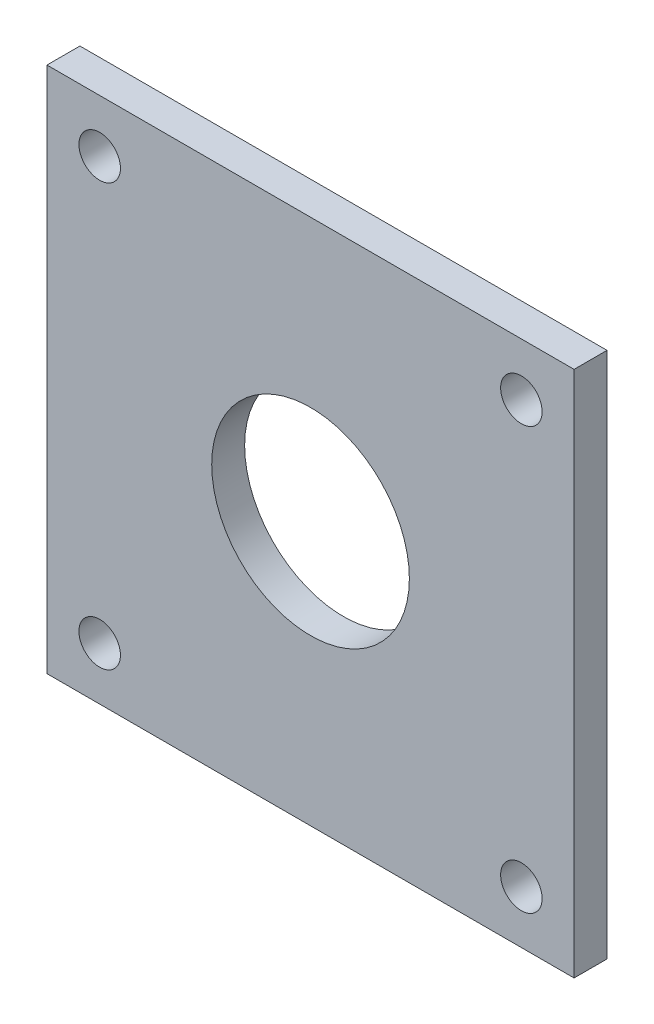
ISO-10303-21;
HEADER;
FILE_DESCRIPTION(('STEP AP214'),'2;1');
FILE_NAME('part.step','',(''),(''),'','','');
FILE_SCHEMA(('AUTOMOTIVE_DESIGN { 1 0 10303 214 1 1 1 1 }'));
ENDSEC;
DATA;
#1=APPLICATION_CONTEXT('core data for automotive mechanical design processes');
#2=APPLICATION_PROTOCOL_DEFINITION('international standard','automotive_design',2000,#1);
#3=PRODUCT_CONTEXT('',#1,'mechanical');
#4=PRODUCT('Part','Part','',(#3));
#5=PRODUCT_RELATED_PRODUCT_CATEGORY('part','',(#4));
#6=PRODUCT_DEFINITION_FORMATION('','',#4);
#7=PRODUCT_DEFINITION_CONTEXT('part definition',#1,'design');
#8=PRODUCT_DEFINITION('design','',#6,#7);
#9=PRODUCT_DEFINITION_SHAPE('','',#8);
#10=(LENGTH_UNIT() NAMED_UNIT(*) SI_UNIT(.MILLI.,.METRE.));
#11=(NAMED_UNIT(*) PLANE_ANGLE_UNIT() SI_UNIT($,.RADIAN.));
#12=(NAMED_UNIT(*) SI_UNIT($,.STERADIAN.) SOLID_ANGLE_UNIT());
#13=UNCERTAINTY_MEASURE_WITH_UNIT(LENGTH_MEASURE(1.E-05),#10,'distance_accuracy_value','');
#14=(GEOMETRIC_REPRESENTATION_CONTEXT(3) GLOBAL_UNCERTAINTY_ASSIGNED_CONTEXT((#13)) GLOBAL_UNIT_ASSIGNED_CONTEXT((#10,
#11,#12)) REPRESENTATION_CONTEXT('',''));
#15=CARTESIAN_POINT('',(0.,0.,0.));
#16=DIRECTION('',(0.,0.,1.));
#17=DIRECTION('',(1.,0.,0.));
#18=AXIS2_PLACEMENT_3D('',#15,#16,#17);
#19=CARTESIAN_POINT('',(0.,50.8,3.175));
#20=DIRECTION('',(0.,0.,-1.));
#21=DIRECTION('',(-1.,0.,0.));
#22=AXIS2_PLACEMENT_3D('',#19,#20,#21);
#23=PLANE('',#22);
#24=CARTESIAN_POINT('',(5.08,5.08,3.175));
#25=DIRECTION('',(0.,0.,1.));
#26=DIRECTION('',(1.,0.,0.));
#27=AXIS2_PLACEMENT_3D('',#24,#25,#26);
#28=CIRCLE('',#27,2.);
#29=CARTESIAN_POINT('',(7.08,5.08,3.175));
#30=VERTEX_POINT('',#29);
#31=EDGE_CURVE('E125',#30,#30,#28,.T.);
#32=ORIENTED_EDGE('',*,*,#31,.F.);
#33=EDGE_LOOP('',(#32));
#34=FACE_BOUND('',#33,.T.);
#35=CARTESIAN_POINT('',(45.72,45.72,3.175));
#36=DIRECTION('',(0.,0.,1.));
#37=DIRECTION('',(1.,0.,0.));
#38=AXIS2_PLACEMENT_3D('',#35,#36,#37);
#39=CIRCLE('',#38,2.);
#40=CARTESIAN_POINT('',(47.72,45.72,3.175));
#41=VERTEX_POINT('',#40);
#42=EDGE_CURVE('E113',#41,#41,#39,.T.);
#43=ORIENTED_EDGE('',*,*,#42,.F.);
#44=EDGE_LOOP('',(#43));
#45=FACE_BOUND('',#44,.T.);
#46=DIRECTION('',(0.,-1.,0.));
#47=VECTOR('',#46,1.);
#48=CARTESIAN_POINT('',(0.,0.,3.175));
#49=LINE('',#48,#47);
#50=CARTESIAN_POINT('',(0.,50.8,3.175));
#51=VERTEX_POINT('',#50);
#52=CARTESIAN_POINT('',(0.,0.,3.175));
#53=VERTEX_POINT('',#52);
#54=EDGE_CURVE('E83',#51,#53,#49,.T.);
#55=ORIENTED_EDGE('',*,*,#54,.T.);
#56=DIRECTION('',(1.,0.,0.));
#57=VECTOR('',#56,1.);
#58=CARTESIAN_POINT('',(0.,0.,3.175));
#59=LINE('',#58,#57);
#60=CARTESIAN_POINT('',(50.8,0.,3.175));
#61=VERTEX_POINT('',#60);
#62=EDGE_CURVE('E78',#53,#61,#59,.T.);
#63=ORIENTED_EDGE('',*,*,#62,.T.);
#64=DIRECTION('',(0.,1.,0.));
#65=VECTOR('',#64,1.);
#66=CARTESIAN_POINT('',(50.8,0.,3.175));
#67=LINE('',#66,#65);
#68=CARTESIAN_POINT('',(50.8,50.8,3.175));
#69=VERTEX_POINT('',#68);
#70=EDGE_CURVE('E81',#61,#69,#67,.T.);
#71=ORIENTED_EDGE('',*,*,#70,.T.);
#72=DIRECTION('',(-1.,0.,0.));
#73=VECTOR('',#72,1.);
#74=CARTESIAN_POINT('',(0.,50.8,3.175));
#75=LINE('',#74,#73);
#76=EDGE_CURVE('E48',#69,#51,#75,.T.);
#77=ORIENTED_EDGE('',*,*,#76,.T.);
#78=EDGE_LOOP('',(#55,#63,#71,#77));
#79=FACE_BOUND('',#78,.T.);
#80=CARTESIAN_POINT('',(5.08,45.72,3.175));
#81=DIRECTION('',(0.,0.,1.));
#82=DIRECTION('',(1.,0.,0.));
#83=AXIS2_PLACEMENT_3D('',#80,#81,#82);
#84=CIRCLE('',#83,2.);
#85=CARTESIAN_POINT('',(7.08,45.72,3.175));
#86=VERTEX_POINT('',#85);
#87=EDGE_CURVE('E98',#86,#86,#84,.T.);
#88=ORIENTED_EDGE('',*,*,#87,.F.);
#89=EDGE_LOOP('',(#88));
#90=FACE_BOUND('',#89,.T.);
#91=CARTESIAN_POINT('',(45.72,5.08,3.175));
#92=DIRECTION('',(0.,0.,1.));
#93=DIRECTION('',(1.,0.,0.));
#94=AXIS2_PLACEMENT_3D('',#91,#92,#93);
#95=CIRCLE('',#94,2.);
#96=CARTESIAN_POINT('',(47.72,5.08,3.175));
#97=VERTEX_POINT('',#96);
#98=EDGE_CURVE('E119',#97,#97,#95,.T.);
#99=ORIENTED_EDGE('',*,*,#98,.F.);
#100=EDGE_LOOP('',(#99));
#101=FACE_BOUND('',#100,.T.);
#102=CARTESIAN_POINT('',(25.4,25.4,3.175));
#103=DIRECTION('',(0.,0.,1.));
#104=DIRECTION('',(1.,0.,0.));
#105=AXIS2_PLACEMENT_3D('',#102,#103,#104);
#106=CIRCLE('',#105,9.525);
#107=CARTESIAN_POINT('',(34.925,25.4,3.175));
#108=VERTEX_POINT('',#107);
#109=EDGE_CURVE('E131',#108,#108,#106,.T.);
#110=ORIENTED_EDGE('',*,*,#109,.F.);
#111=EDGE_LOOP('',(#110));
#112=FACE_BOUND('',#111,.T.);
#113=ADVANCED_FACE('F31',(#34,#45,#79,#90,#101,#112),#23,.F.);
#114=CARTESIAN_POINT('',(0.,50.8,0.));
#115=DIRECTION('',(0.,0.,-1.));
#116=DIRECTION('',(-1.,0.,0.));
#117=AXIS2_PLACEMENT_3D('',#114,#115,#116);
#118=PLANE('',#117);
#119=CARTESIAN_POINT('',(5.08,5.08,0.));
#120=DIRECTION('',(0.,0.,1.));
#121=DIRECTION('',(1.,0.,0.));
#122=AXIS2_PLACEMENT_3D('',#119,#120,#121);
#123=CIRCLE('',#122,2.);
#124=CARTESIAN_POINT('',(7.08,5.08,0.));
#125=VERTEX_POINT('',#124);
#126=EDGE_CURVE('E128',#125,#125,#123,.T.);
#127=ORIENTED_EDGE('',*,*,#126,.T.);
#128=EDGE_LOOP('',(#127));
#129=FACE_BOUND('',#128,.T.);
#130=CARTESIAN_POINT('',(45.72,45.72,0.));
#131=DIRECTION('',(0.,0.,1.));
#132=DIRECTION('',(1.,0.,0.));
#133=AXIS2_PLACEMENT_3D('',#130,#131,#132);
#134=CIRCLE('',#133,2.);
#135=CARTESIAN_POINT('',(47.72,45.72,0.));
#136=VERTEX_POINT('',#135);
#137=EDGE_CURVE('E116',#136,#136,#134,.T.);
#138=ORIENTED_EDGE('',*,*,#137,.T.);
#139=EDGE_LOOP('',(#138));
#140=FACE_BOUND('',#139,.T.);
#141=DIRECTION('',(0.,-1.,0.));
#142=VECTOR('',#141,1.);
#143=CARTESIAN_POINT('',(0.,0.,0.));
#144=LINE('',#143,#142);
#145=CARTESIAN_POINT('',(0.,50.8,0.));
#146=VERTEX_POINT('',#145);
#147=CARTESIAN_POINT('',(0.,0.,0.));
#148=VERTEX_POINT('',#147);
#149=EDGE_CURVE('E95',#146,#148,#144,.T.);
#150=ORIENTED_EDGE('',*,*,#149,.F.);
#151=DIRECTION('',(-1.,0.,0.));
#152=VECTOR('',#151,1.);
#153=CARTESIAN_POINT('',(0.,50.8,0.));
#154=LINE('',#153,#152);
#155=CARTESIAN_POINT('',(50.8,50.8,0.));
#156=VERTEX_POINT('',#155);
#157=EDGE_CURVE('E71',#156,#146,#154,.T.);
#158=ORIENTED_EDGE('',*,*,#157,.F.);
#159=DIRECTION('',(0.,1.,0.));
#160=VECTOR('',#159,1.);
#161=CARTESIAN_POINT('',(50.8,0.,0.));
#162=LINE('',#161,#160);
#163=CARTESIAN_POINT('',(50.8,0.,0.));
#164=VERTEX_POINT('',#163);
#165=EDGE_CURVE('E65',#164,#156,#162,.T.);
#166=ORIENTED_EDGE('',*,*,#165,.F.);
#167=DIRECTION('',(1.,0.,0.));
#168=VECTOR('',#167,1.);
#169=CARTESIAN_POINT('',(0.,0.,0.));
#170=LINE('',#169,#168);
#171=EDGE_CURVE('E87',#148,#164,#170,.T.);
#172=ORIENTED_EDGE('',*,*,#171,.F.);
#173=EDGE_LOOP('',(#150,#158,#166,#172));
#174=FACE_BOUND('',#173,.T.);
#175=CARTESIAN_POINT('',(5.08,45.72,0.));
#176=DIRECTION('',(0.,0.,1.));
#177=DIRECTION('',(1.,0.,0.));
#178=AXIS2_PLACEMENT_3D('',#175,#176,#177);
#179=CIRCLE('',#178,2.);
#180=CARTESIAN_POINT('',(7.08,45.72,0.));
#181=VERTEX_POINT('',#180);
#182=EDGE_CURVE('E110',#181,#181,#179,.T.);
#183=ORIENTED_EDGE('',*,*,#182,.T.);
#184=EDGE_LOOP('',(#183));
#185=FACE_BOUND('',#184,.T.);
#186=CARTESIAN_POINT('',(45.72,5.08,0.));
#187=DIRECTION('',(0.,0.,1.));
#188=DIRECTION('',(1.,0.,0.));
#189=AXIS2_PLACEMENT_3D('',#186,#187,#188);
#190=CIRCLE('',#189,2.);
#191=CARTESIAN_POINT('',(47.72,5.08,0.));
#192=VERTEX_POINT('',#191);
#193=EDGE_CURVE('E122',#192,#192,#190,.T.);
#194=ORIENTED_EDGE('',*,*,#193,.T.);
#195=EDGE_LOOP('',(#194));
#196=FACE_BOUND('',#195,.T.);
#197=CARTESIAN_POINT('',(25.4,25.4,0.));
#198=DIRECTION('',(0.,0.,1.));
#199=DIRECTION('',(1.,0.,0.));
#200=AXIS2_PLACEMENT_3D('',#197,#198,#199);
#201=CIRCLE('',#200,9.525);
#202=CARTESIAN_POINT('',(34.925,25.4,0.));
#203=VERTEX_POINT('',#202);
#204=EDGE_CURVE('E134',#203,#203,#201,.T.);
#205=ORIENTED_EDGE('',*,*,#204,.T.);
#206=EDGE_LOOP('',(#205));
#207=FACE_BOUND('',#206,.T.);
#208=ADVANCED_FACE('F106',(#129,#140,#174,#185,#196,#207),#118,.T.);
#209=CARTESIAN_POINT('',(0.,0.,3.175));
#210=DIRECTION('',(1.,0.,0.));
#211=DIRECTION('',(0.,1.,0.));
#212=AXIS2_PLACEMENT_3D('',#209,#210,#211);
#213=PLANE('',#212);
#214=ORIENTED_EDGE('',*,*,#149,.T.);
#215=DIRECTION('',(0.,0.,-1.));
#216=VECTOR('',#215,1.);
#217=CARTESIAN_POINT('',(0.,0.,3.175));
#218=LINE('',#217,#216);
#219=EDGE_CURVE('E11',#53,#148,#218,.T.);
#220=ORIENTED_EDGE('',*,*,#219,.F.);
#221=ORIENTED_EDGE('',*,*,#54,.F.);
#222=DIRECTION('',(0.,0.,-1.));
#223=VECTOR('',#222,1.);
#224=CARTESIAN_POINT('',(0.,50.8,3.175));
#225=LINE('',#224,#223);
#226=EDGE_CURVE('E91',#51,#146,#225,.T.);
#227=ORIENTED_EDGE('',*,*,#226,.T.);
#228=EDGE_LOOP('',(#214,#220,#221,#227));
#229=FACE_BOUND('',#228,.T.);
#230=ADVANCED_FACE('F33',(#229),#213,.F.);
#231=CARTESIAN_POINT('',(0.,0.,3.175));
#232=DIRECTION('',(0.,1.,0.));
#233=DIRECTION('',(0.,0.,1.));
#234=AXIS2_PLACEMENT_3D('',#231,#232,#233);
#235=PLANE('',#234);
#236=ORIENTED_EDGE('',*,*,#171,.T.);
#237=DIRECTION('',(0.,0.,-1.));
#238=VECTOR('',#237,1.);
#239=CARTESIAN_POINT('',(50.8,0.,3.175));
#240=LINE('',#239,#238);
#241=EDGE_CURVE('E40',#61,#164,#240,.T.);
#242=ORIENTED_EDGE('',*,*,#241,.F.);
#243=ORIENTED_EDGE('',*,*,#62,.F.);
#244=ORIENTED_EDGE('',*,*,#219,.T.);
#245=EDGE_LOOP('',(#236,#242,#243,#244));
#246=FACE_BOUND('',#245,.T.);
#247=ADVANCED_FACE('F86',(#246),#235,.F.);
#248=CARTESIAN_POINT('',(50.8,0.,3.175));
#249=DIRECTION('',(-1.,0.,0.));
#250=DIRECTION('',(0.,-1.,0.));
#251=AXIS2_PLACEMENT_3D('',#248,#249,#250);
#252=PLANE('',#251);
#253=ORIENTED_EDGE('',*,*,#165,.T.);
#254=DIRECTION('',(0.,0.,-1.));
#255=VECTOR('',#254,1.);
#256=CARTESIAN_POINT('',(50.8,50.8,3.175));
#257=LINE('',#256,#255);
#258=EDGE_CURVE('E88',#69,#156,#257,.T.);
#259=ORIENTED_EDGE('',*,*,#258,.F.);
#260=ORIENTED_EDGE('',*,*,#70,.F.);
#261=ORIENTED_EDGE('',*,*,#241,.T.);
#262=EDGE_LOOP('',(#253,#259,#260,#261));
#263=FACE_BOUND('',#262,.T.);
#264=ADVANCED_FACE('F89',(#263),#252,.F.);
#265=CARTESIAN_POINT('',(0.,50.8,3.175));
#266=DIRECTION('',(0.,-1.,0.));
#267=DIRECTION('',(0.,0.,-1.));
#268=AXIS2_PLACEMENT_3D('',#265,#266,#267);
#269=PLANE('',#268);
#270=ORIENTED_EDGE('',*,*,#157,.T.);
#271=ORIENTED_EDGE('',*,*,#226,.F.);
#272=ORIENTED_EDGE('',*,*,#76,.F.);
#273=ORIENTED_EDGE('',*,*,#258,.T.);
#274=EDGE_LOOP('',(#270,#271,#272,#273));
#275=FACE_BOUND('',#274,.T.);
#276=ADVANCED_FACE('F103',(#275),#269,.F.);
#277=CARTESIAN_POINT('',(5.08,45.72,3.175));
#278=DIRECTION('',(0.,0.,-1.));
#279=DIRECTION('',(-1.,0.,0.));
#280=AXIS2_PLACEMENT_3D('',#277,#278,#279);
#281=CYLINDRICAL_SURFACE('',#280,2.);
#282=ORIENTED_EDGE('',*,*,#87,.T.);
#283=EDGE_LOOP('',(#282));
#284=FACE_BOUND('',#283,.T.);
#285=ORIENTED_EDGE('',*,*,#182,.F.);
#286=EDGE_LOOP('',(#285));
#287=FACE_BOUND('',#286,.T.);
#288=ADVANCED_FACE('F154',(#284,#287),#281,.F.);
#289=CARTESIAN_POINT('',(45.72,45.72,3.175));
#290=DIRECTION('',(0.,0.,-1.));
#291=DIRECTION('',(-1.,0.,0.));
#292=AXIS2_PLACEMENT_3D('',#289,#290,#291);
#293=CYLINDRICAL_SURFACE('',#292,2.);
#294=ORIENTED_EDGE('',*,*,#42,.T.);
#295=EDGE_LOOP('',(#294));
#296=FACE_BOUND('',#295,.T.);
#297=ORIENTED_EDGE('',*,*,#137,.F.);
#298=EDGE_LOOP('',(#297));
#299=FACE_BOUND('',#298,.T.);
#300=ADVANCED_FACE('F200',(#296,#299),#293,.F.);
#301=CARTESIAN_POINT('',(45.72,5.08,3.175));
#302=DIRECTION('',(0.,0.,-1.));
#303=DIRECTION('',(-1.,0.,0.));
#304=AXIS2_PLACEMENT_3D('',#301,#302,#303);
#305=CYLINDRICAL_SURFACE('',#304,2.);
#306=ORIENTED_EDGE('',*,*,#98,.T.);
#307=EDGE_LOOP('',(#306));
#308=FACE_BOUND('',#307,.T.);
#309=ORIENTED_EDGE('',*,*,#193,.F.);
#310=EDGE_LOOP('',(#309));
#311=FACE_BOUND('',#310,.T.);
#312=ADVANCED_FACE('F208',(#308,#311),#305,.F.);
#313=CARTESIAN_POINT('',(5.08,5.08,3.175));
#314=DIRECTION('',(0.,0.,-1.));
#315=DIRECTION('',(-1.,0.,0.));
#316=AXIS2_PLACEMENT_3D('',#313,#314,#315);
#317=CYLINDRICAL_SURFACE('',#316,2.);
#318=ORIENTED_EDGE('',*,*,#31,.T.);
#319=EDGE_LOOP('',(#318));
#320=FACE_BOUND('',#319,.T.);
#321=ORIENTED_EDGE('',*,*,#126,.F.);
#322=EDGE_LOOP('',(#321));
#323=FACE_BOUND('',#322,.T.);
#324=ADVANCED_FACE('F216',(#320,#323),#317,.F.);
#325=CARTESIAN_POINT('',(25.4,25.4,3.175));
#326=DIRECTION('',(0.,0.,-1.));
#327=DIRECTION('',(-1.,0.,0.));
#328=AXIS2_PLACEMENT_3D('',#325,#326,#327);
#329=CYLINDRICAL_SURFACE('',#328,9.525);
#330=ORIENTED_EDGE('',*,*,#109,.T.);
#331=EDGE_LOOP('',(#330));
#332=FACE_BOUND('',#331,.T.);
#333=ORIENTED_EDGE('',*,*,#204,.F.);
#334=EDGE_LOOP('',(#333));
#335=FACE_BOUND('',#334,.T.);
#336=ADVANCED_FACE('F140',(#332,#335),#329,.F.);
#337=CLOSED_SHELL('',(#113,#208,#230,#247,#264,#276,#288,#300,#312,#324,#336));
#338=MANIFOLD_SOLID_BREP('B2',#337);
#339=ADVANCED_BREP_SHAPE_REPRESENTATION('',(#18,#338),#14);
#340=SHAPE_DEFINITION_REPRESENTATION(#9,#339);
ENDSEC;
END-ISO-10303-21;
